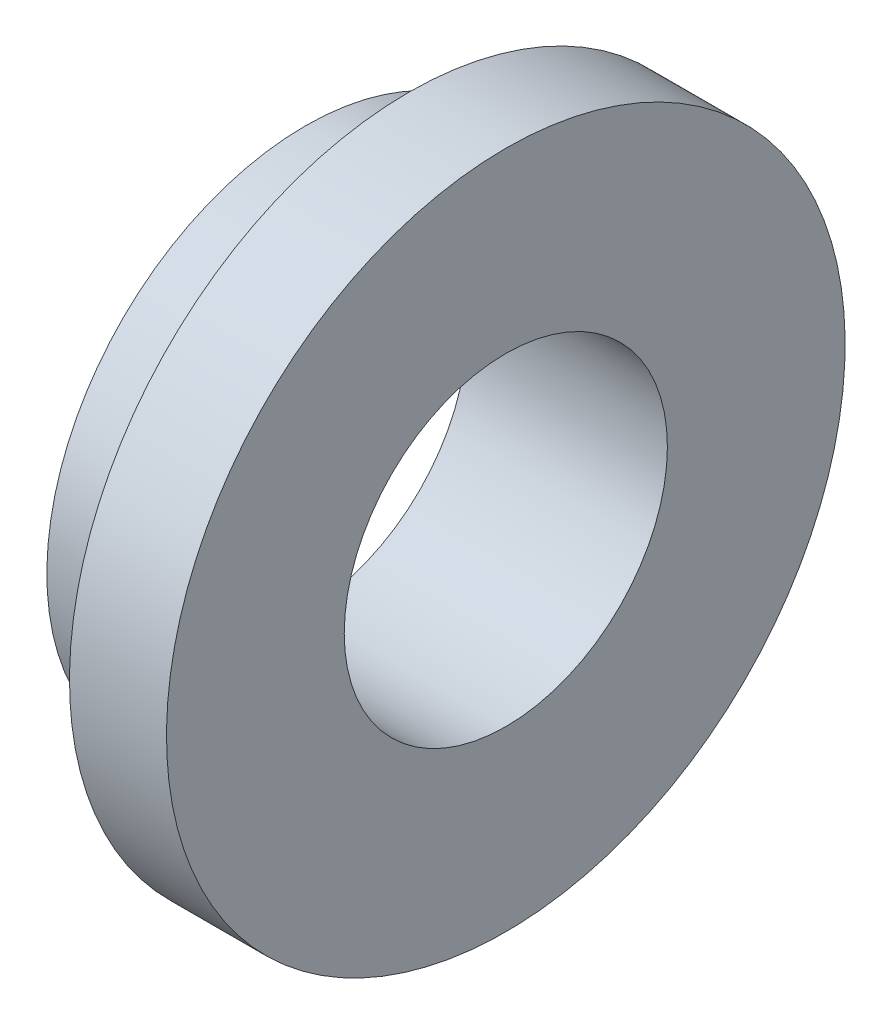
ISO-10303-21;
HEADER;
FILE_DESCRIPTION(('STEP AP214'),'2;1');
FILE_NAME('part.step','',(''),(''),'','','');
FILE_SCHEMA(('AUTOMOTIVE_DESIGN { 1 0 10303 214 1 1 1 1 }'));
ENDSEC;
DATA;
#1=APPLICATION_CONTEXT('core data for automotive mechanical design processes');
#2=APPLICATION_PROTOCOL_DEFINITION('international standard','automotive_design',2000,#1);
#3=PRODUCT_CONTEXT('',#1,'mechanical');
#4=PRODUCT('Part','Part','',(#3));
#5=PRODUCT_RELATED_PRODUCT_CATEGORY('part','',(#4));
#6=PRODUCT_DEFINITION_FORMATION('','',#4);
#7=PRODUCT_DEFINITION_CONTEXT('part definition',#1,'design');
#8=PRODUCT_DEFINITION('design','',#6,#7);
#9=PRODUCT_DEFINITION_SHAPE('','',#8);
#10=(LENGTH_UNIT() NAMED_UNIT(*) SI_UNIT(.MILLI.,.METRE.));
#11=(NAMED_UNIT(*) PLANE_ANGLE_UNIT() SI_UNIT($,.RADIAN.));
#12=(NAMED_UNIT(*) SI_UNIT($,.STERADIAN.) SOLID_ANGLE_UNIT());
#13=UNCERTAINTY_MEASURE_WITH_UNIT(LENGTH_MEASURE(1.E-05),#10,'distance_accuracy_value','');
#14=(GEOMETRIC_REPRESENTATION_CONTEXT(3) GLOBAL_UNCERTAINTY_ASSIGNED_CONTEXT((#13)) GLOBAL_UNIT_ASSIGNED_CONTEXT((#10,
#11,#12)) REPRESENTATION_CONTEXT('',''));
#15=CARTESIAN_POINT('',(0.,0.,0.));
#16=DIRECTION('',(0.,0.,1.));
#17=DIRECTION('',(1.,0.,0.));
#18=AXIS2_PLACEMENT_3D('',#15,#16,#17);
#19=CARTESIAN_POINT('',(-2.46126,1.984375,0.));
#20=DIRECTION('',(-1.,0.,0.));
#21=DIRECTION('',(0.,-1.,0.));
#22=AXIS2_PLACEMENT_3D('',#19,#20,#21);
#23=PLANE('',#22);
#24=CARTESIAN_POINT('',(-2.46126,0.,0.));
#25=DIRECTION('',(1.,0.,0.));
#26=DIRECTION('',(0.,1.,0.));
#27=AXIS2_PLACEMENT_3D('',#24,#25,#26);
#28=CIRCLE('',#27,1.984375);
#29=CARTESIAN_POINT('',(-2.46126,1.984375,0.));
#30=VERTEX_POINT('',#29);
#31=EDGE_CURVE('E53',#30,#30,#28,.T.);
#32=ORIENTED_EDGE('',*,*,#31,.T.);
#33=EDGE_LOOP('',(#32));
#34=FACE_BOUND('',#33,.T.);
#35=CARTESIAN_POINT('',(-2.46126,0.,0.));
#36=DIRECTION('',(1.,0.,0.));
#37=DIRECTION('',(0.,1.,0.));
#38=AXIS2_PLACEMENT_3D('',#35,#36,#37);
#39=CIRCLE('',#38,3.175);
#40=CARTESIAN_POINT('',(-2.46126,3.175,0.));
#41=VERTEX_POINT('',#40);
#42=EDGE_CURVE('E10',#41,#41,#39,.T.);
#43=ORIENTED_EDGE('',*,*,#42,.F.);
#44=EDGE_LOOP('',(#43));
#45=FACE_BOUND('',#44,.T.);
#46=ADVANCED_FACE('F31',(#34,#45),#23,.T.);
#47=CARTESIAN_POINT('',(12.9968024531849,0.,0.));
#48=DIRECTION('',(1.,0.,0.));
#49=DIRECTION('',(0.,1.,0.));
#50=AXIS2_PLACEMENT_3D('',#47,#48,#49);
#51=CYLINDRICAL_SURFACE('',#50,3.175);
#52=ORIENTED_EDGE('',*,*,#42,.T.);
#53=EDGE_LOOP('',(#52));
#54=FACE_BOUND('',#53,.T.);
#55=CARTESIAN_POINT('',(-1.19126,0.,0.));
#56=DIRECTION('',(1.,0.,0.));
#57=DIRECTION('',(0.,1.,0.));
#58=AXIS2_PLACEMENT_3D('',#55,#56,#57);
#59=CIRCLE('',#58,3.175);
#60=CARTESIAN_POINT('',(-1.19126,3.175,0.));
#61=VERTEX_POINT('',#60);
#62=EDGE_CURVE('E37',#61,#61,#59,.T.);
#63=ORIENTED_EDGE('',*,*,#62,.F.);
#64=EDGE_LOOP('',(#63));
#65=FACE_BOUND('',#64,.T.);
#66=ADVANCED_FACE('F71',(#54,#65),#51,.T.);
#67=CARTESIAN_POINT('',(-1.19126,3.175,0.));
#68=DIRECTION('',(-1.,0.,0.));
#69=DIRECTION('',(0.,-1.,0.));
#70=AXIS2_PLACEMENT_3D('',#67,#68,#69);
#71=PLANE('',#70);
#72=ORIENTED_EDGE('',*,*,#62,.T.);
#73=EDGE_LOOP('',(#72));
#74=FACE_BOUND('',#73,.T.);
#75=CARTESIAN_POINT('',(-1.19126,0.,0.));
#76=DIRECTION('',(1.,0.,0.));
#77=DIRECTION('',(0.,1.,0.));
#78=AXIS2_PLACEMENT_3D('',#75,#76,#77);
#79=CIRCLE('',#78,4.1671875);
#80=CARTESIAN_POINT('',(-1.19126,4.1671875,0.));
#81=VERTEX_POINT('',#80);
#82=EDGE_CURVE('E41',#81,#81,#79,.T.);
#83=ORIENTED_EDGE('',*,*,#82,.F.);
#84=EDGE_LOOP('',(#83));
#85=FACE_BOUND('',#84,.T.);
#86=ADVANCED_FACE('F75',(#74,#85),#71,.T.);
#87=CARTESIAN_POINT('',(12.9968024531849,0.,0.));
#88=DIRECTION('',(1.,0.,0.));
#89=DIRECTION('',(0.,1.,0.));
#90=AXIS2_PLACEMENT_3D('',#87,#88,#89);
#91=CYLINDRICAL_SURFACE('',#90,4.1671875);
#92=ORIENTED_EDGE('',*,*,#82,.T.);
#93=EDGE_LOOP('',(#92));
#94=FACE_BOUND('',#93,.T.);
#95=CARTESIAN_POINT('',(0.,0.,0.));
#96=DIRECTION('',(1.,0.,0.));
#97=DIRECTION('',(0.,1.,0.));
#98=AXIS2_PLACEMENT_3D('',#95,#96,#97);
#99=CIRCLE('',#98,4.1671875);
#100=CARTESIAN_POINT('',(0.,4.1671875,0.));
#101=VERTEX_POINT('',#100);
#102=EDGE_CURVE('E45',#101,#101,#99,.T.);
#103=ORIENTED_EDGE('',*,*,#102,.F.);
#104=EDGE_LOOP('',(#103));
#105=FACE_BOUND('',#104,.T.);
#106=ADVANCED_FACE('F67',(#94,#105),#91,.T.);
#107=CARTESIAN_POINT('',(0.,4.1671875,0.));
#108=DIRECTION('',(1.,0.,0.));
#109=DIRECTION('',(0.,1.,0.));
#110=AXIS2_PLACEMENT_3D('',#107,#108,#109);
#111=PLANE('',#110);
#112=ORIENTED_EDGE('',*,*,#102,.T.);
#113=EDGE_LOOP('',(#112));
#114=FACE_BOUND('',#113,.T.);
#115=CARTESIAN_POINT('',(0.,0.,0.));
#116=DIRECTION('',(1.,0.,0.));
#117=DIRECTION('',(0.,1.,0.));
#118=AXIS2_PLACEMENT_3D('',#115,#116,#117);
#119=CIRCLE('',#118,1.984375);
#120=CARTESIAN_POINT('',(0.,1.984375,0.));
#121=VERTEX_POINT('',#120);
#122=EDGE_CURVE('E50',#121,#121,#119,.T.);
#123=ORIENTED_EDGE('',*,*,#122,.F.);
#124=EDGE_LOOP('',(#123));
#125=FACE_BOUND('',#124,.T.);
#126=ADVANCED_FACE('F61',(#114,#125),#111,.T.);
#127=CARTESIAN_POINT('',(12.9968024531849,0.,0.));
#128=DIRECTION('',(1.,0.,0.));
#129=DIRECTION('',(0.,1.,0.));
#130=AXIS2_PLACEMENT_3D('',#127,#128,#129);
#131=CYLINDRICAL_SURFACE('',#130,1.984375);
#132=ORIENTED_EDGE('',*,*,#122,.T.);
#133=EDGE_LOOP('',(#132));
#134=FACE_BOUND('',#133,.T.);
#135=ORIENTED_EDGE('',*,*,#31,.F.);
#136=EDGE_LOOP('',(#135));
#137=FACE_BOUND('',#136,.T.);
#138=ADVANCED_FACE('F59',(#134,#137),#131,.F.);
#139=CLOSED_SHELL('',(#46,#66,#86,#106,#126,#138));
#140=MANIFOLD_SOLID_BREP('B2',#139);
#141=ADVANCED_BREP_SHAPE_REPRESENTATION('',(#18,#140),#14);
#142=SHAPE_DEFINITION_REPRESENTATION(#9,#141);
ENDSEC;
END-ISO-10303-21;
